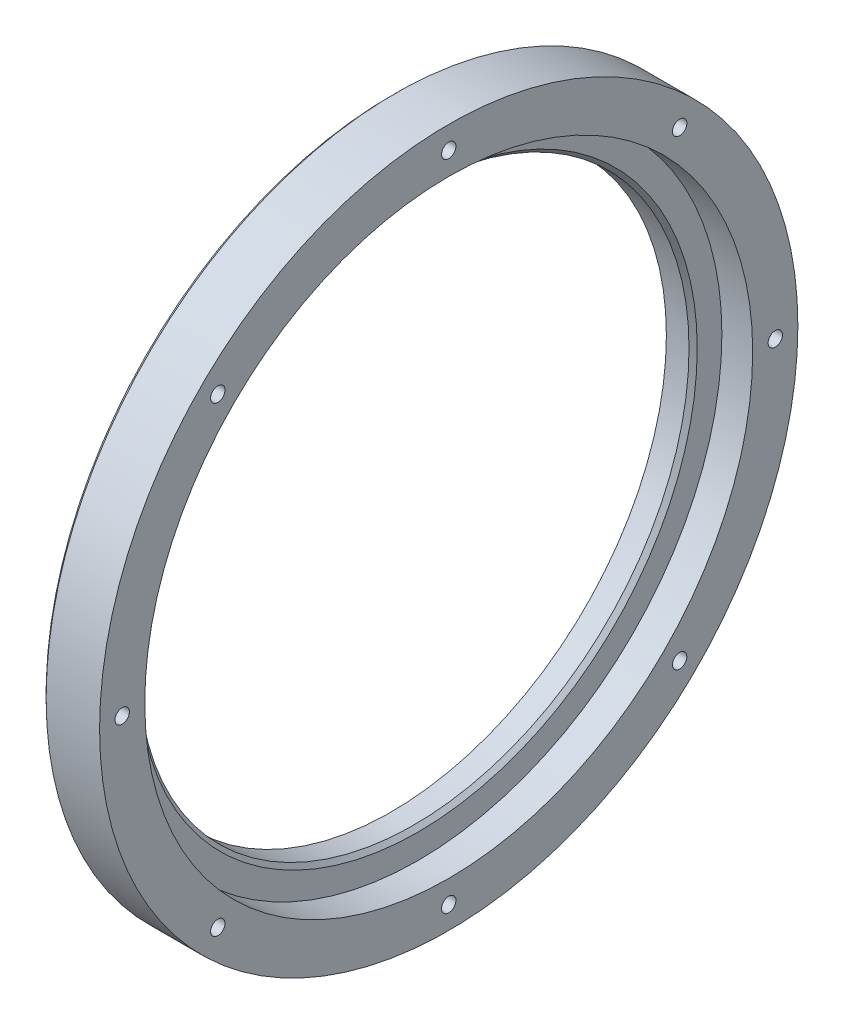
ISO-10303-21;
HEADER;
FILE_DESCRIPTION(('STEP AP214'),'2;1');
FILE_NAME('part.step','',(''),(''),'','','');
FILE_SCHEMA(('AUTOMOTIVE_DESIGN { 1 0 10303 214 1 1 1 1 }'));
ENDSEC;
DATA;
#1=APPLICATION_CONTEXT('core data for automotive mechanical design processes');
#2=APPLICATION_PROTOCOL_DEFINITION('international standard','automotive_design',2000,#1);
#3=PRODUCT_CONTEXT('',#1,'mechanical');
#4=PRODUCT('Part','Part','',(#3));
#5=PRODUCT_RELATED_PRODUCT_CATEGORY('part','',(#4));
#6=PRODUCT_DEFINITION_FORMATION('','',#4);
#7=PRODUCT_DEFINITION_CONTEXT('part definition',#1,'design');
#8=PRODUCT_DEFINITION('design','',#6,#7);
#9=PRODUCT_DEFINITION_SHAPE('','',#8);
#10=(LENGTH_UNIT() NAMED_UNIT(*) SI_UNIT(.MILLI.,.METRE.));
#11=(NAMED_UNIT(*) PLANE_ANGLE_UNIT() SI_UNIT($,.RADIAN.));
#12=(NAMED_UNIT(*) SI_UNIT($,.STERADIAN.) SOLID_ANGLE_UNIT());
#13=UNCERTAINTY_MEASURE_WITH_UNIT(LENGTH_MEASURE(1.E-05),#10,'distance_accuracy_value','');
#14=(GEOMETRIC_REPRESENTATION_CONTEXT(3) GLOBAL_UNCERTAINTY_ASSIGNED_CONTEXT((#13)) GLOBAL_UNIT_ASSIGNED_CONTEXT((#10,
#11,#12)) REPRESENTATION_CONTEXT('',''));
#15=CARTESIAN_POINT('',(0.,0.,0.));
#16=DIRECTION('',(0.,0.,1.));
#17=DIRECTION('',(1.,0.,0.));
#18=AXIS2_PLACEMENT_3D('',#15,#16,#17);
#19=CARTESIAN_POINT('',(-272.858046522507,57.2242590790327,56.2149891043305));
#20=DIRECTION('',(-1.,0.,0.));
#21=DIRECTION('',(0.,0.,1.));
#22=AXIS2_PLACEMENT_3D('',#19,#20,#21);
#23=CYLINDRICAL_SURFACE('',#22,1.75000000000001);
#24=CARTESIAN_POINT('',(-272.858046522507,57.2242590790327,56.2149891043305));
#25=DIRECTION('',(-1.,0.,0.));
#26=DIRECTION('',(0.,0.,1.));
#27=AXIS2_PLACEMENT_3D('',#24,#25,#26);
#28=CIRCLE('',#27,1.75000000000001);
#29=CARTESIAN_POINT('',(-272.858046522507,57.2242590790327,57.9649891043306));
#30=VERTEX_POINT('',#29);
#31=EDGE_CURVE('E89',#30,#30,#28,.T.);
#32=ORIENTED_EDGE('',*,*,#31,.F.);
#33=EDGE_LOOP('',(#32));
#34=FACE_BOUND('',#33,.T.);
#35=CARTESIAN_POINT('',(-282.871214875946,57.2242590790327,56.2149891043305));
#36=DIRECTION('',(-1.,0.,0.));
#37=DIRECTION('',(0.,0.,1.));
#38=AXIS2_PLACEMENT_3D('',#35,#36,#37);
#39=CIRCLE('',#38,1.75000000000001);
#40=CARTESIAN_POINT('',(-282.871214875946,57.2242590790327,57.9649891043306));
#41=VERTEX_POINT('',#40);
#42=EDGE_CURVE('E52',#41,#41,#39,.F.);
#43=ORIENTED_EDGE('',*,*,#42,.F.);
#44=EDGE_LOOP('',(#43));
#45=FACE_BOUND('',#44,.T.);
#46=ADVANCED_FACE('F34',(#34,#45),#23,.F.);
#47=CARTESIAN_POINT('',(-272.858046522507,80.5092699747022,0.));
#48=DIRECTION('',(-1.,0.,0.));
#49=DIRECTION('',(0.,0.,1.));
#50=AXIS2_PLACEMENT_3D('',#47,#48,#49);
#51=CYLINDRICAL_SURFACE('',#50,1.75000000000001);
#52=CARTESIAN_POINT('',(-272.858046522507,80.5092699747022,0.));
#53=DIRECTION('',(-1.,0.,0.));
#54=DIRECTION('',(0.,0.,1.));
#55=AXIS2_PLACEMENT_3D('',#52,#53,#54);
#56=CIRCLE('',#55,1.75000000000001);
#57=CARTESIAN_POINT('',(-272.858046522507,80.5092699747022,1.75000000000001));
#58=VERTEX_POINT('',#57);
#59=EDGE_CURVE('E124',#58,#58,#56,.T.);
#60=ORIENTED_EDGE('',*,*,#59,.F.);
#61=EDGE_LOOP('',(#60));
#62=FACE_BOUND('',#61,.T.);
#63=CARTESIAN_POINT('',(-282.871214875946,80.5092699747022,0.));
#64=DIRECTION('',(-1.,0.,0.));
#65=DIRECTION('',(0.,0.,1.));
#66=AXIS2_PLACEMENT_3D('',#63,#64,#65);
#67=CIRCLE('',#66,1.75000000000001);
#68=CARTESIAN_POINT('',(-282.871214875946,80.5092699747022,1.75000000000001));
#69=VERTEX_POINT('',#68);
#70=EDGE_CURVE('E57',#69,#69,#67,.F.);
#71=ORIENTED_EDGE('',*,*,#70,.F.);
#72=EDGE_LOOP('',(#71));
#73=FACE_BOUND('',#72,.T.);
#74=ADVANCED_FACE('F229',(#62,#73),#51,.F.);
#75=CARTESIAN_POINT('',(-272.858046522507,57.2242590790327,-56.2149891043305));
#76=DIRECTION('',(-1.,0.,0.));
#77=DIRECTION('',(0.,0.,1.));
#78=AXIS2_PLACEMENT_3D('',#75,#76,#77);
#79=CYLINDRICAL_SURFACE('',#78,1.75000000000001);
#80=CARTESIAN_POINT('',(-272.858046522507,57.2242590790327,-56.2149891043305));
#81=DIRECTION('',(-1.,0.,0.));
#82=DIRECTION('',(0.,0.,1.));
#83=AXIS2_PLACEMENT_3D('',#80,#81,#82);
#84=CIRCLE('',#83,1.75000000000001);
#85=CARTESIAN_POINT('',(-272.858046522507,57.2242590790327,-54.4649891043305));
#86=VERTEX_POINT('',#85);
#87=EDGE_CURVE('E121',#86,#86,#84,.T.);
#88=ORIENTED_EDGE('',*,*,#87,.F.);
#89=EDGE_LOOP('',(#88));
#90=FACE_BOUND('',#89,.T.);
#91=CARTESIAN_POINT('',(-282.871214875946,57.2242590790327,-56.2149891043305));
#92=DIRECTION('',(-1.,0.,0.));
#93=DIRECTION('',(0.,0.,1.));
#94=AXIS2_PLACEMENT_3D('',#91,#92,#93);
#95=CIRCLE('',#94,1.75000000000001);
#96=CARTESIAN_POINT('',(-282.871214875946,57.2242590790327,-54.4649891043305));
#97=VERTEX_POINT('',#96);
#98=EDGE_CURVE('E62',#97,#97,#95,.F.);
#99=ORIENTED_EDGE('',*,*,#98,.F.);
#100=EDGE_LOOP('',(#99));
#101=FACE_BOUND('',#100,.T.);
#102=ADVANCED_FACE('F235',(#90,#101),#79,.F.);
#103=CARTESIAN_POINT('',(-272.858046522507,1.00926997470218,-79.5));
#104=DIRECTION('',(-1.,0.,0.));
#105=DIRECTION('',(0.,0.,1.));
#106=AXIS2_PLACEMENT_3D('',#103,#104,#105);
#107=CYLINDRICAL_SURFACE('',#106,1.75);
#108=CARTESIAN_POINT('',(-272.858046522507,1.00926997470218,-79.5));
#109=DIRECTION('',(-1.,0.,0.));
#110=DIRECTION('',(0.,0.,1.));
#111=AXIS2_PLACEMENT_3D('',#108,#109,#110);
#112=CIRCLE('',#111,1.75);
#113=CARTESIAN_POINT('',(-272.858046522507,1.00926997470218,-77.75));
#114=VERTEX_POINT('',#113);
#115=EDGE_CURVE('E118',#114,#114,#112,.T.);
#116=ORIENTED_EDGE('',*,*,#115,.F.);
#117=EDGE_LOOP('',(#116));
#118=FACE_BOUND('',#117,.T.);
#119=CARTESIAN_POINT('',(-282.871214875946,1.00926997470218,-79.5));
#120=DIRECTION('',(-1.,0.,0.));
#121=DIRECTION('',(0.,0.,1.));
#122=AXIS2_PLACEMENT_3D('',#119,#120,#121);
#123=CIRCLE('',#122,1.75);
#124=CARTESIAN_POINT('',(-282.871214875946,1.00926997470218,-77.75));
#125=VERTEX_POINT('',#124);
#126=EDGE_CURVE('E67',#125,#125,#123,.F.);
#127=ORIENTED_EDGE('',*,*,#126,.F.);
#128=EDGE_LOOP('',(#127));
#129=FACE_BOUND('',#128,.T.);
#130=ADVANCED_FACE('F246',(#118,#129),#107,.F.);
#131=CARTESIAN_POINT('',(-272.858046522507,-55.2057191296284,-56.2149891043306));
#132=DIRECTION('',(-1.,0.,0.));
#133=DIRECTION('',(0.,0.,1.));
#134=AXIS2_PLACEMENT_3D('',#131,#132,#133);
#135=CYLINDRICAL_SURFACE('',#134,1.75000000000001);
#136=CARTESIAN_POINT('',(-272.858046522507,-55.2057191296284,-56.2149891043306));
#137=DIRECTION('',(-1.,0.,0.));
#138=DIRECTION('',(0.,0.,1.));
#139=AXIS2_PLACEMENT_3D('',#136,#137,#138);
#140=CIRCLE('',#139,1.75000000000001);
#141=CARTESIAN_POINT('',(-272.858046522507,-55.2057191296284,-54.4649891043305));
#142=VERTEX_POINT('',#141);
#143=EDGE_CURVE('E115',#142,#142,#140,.T.);
#144=ORIENTED_EDGE('',*,*,#143,.F.);
#145=EDGE_LOOP('',(#144));
#146=FACE_BOUND('',#145,.T.);
#147=CARTESIAN_POINT('',(-282.871214875946,-55.2057191296284,-56.2149891043306));
#148=DIRECTION('',(-1.,0.,0.));
#149=DIRECTION('',(0.,0.,1.));
#150=AXIS2_PLACEMENT_3D('',#147,#148,#149);
#151=CIRCLE('',#150,1.75000000000001);
#152=CARTESIAN_POINT('',(-282.871214875946,-55.2057191296284,-54.4649891043305));
#153=VERTEX_POINT('',#152);
#154=EDGE_CURVE('E72',#153,#153,#151,.F.);
#155=ORIENTED_EDGE('',*,*,#154,.F.);
#156=EDGE_LOOP('',(#155));
#157=FACE_BOUND('',#156,.T.);
#158=ADVANCED_FACE('F250',(#146,#157),#135,.F.);
#159=CARTESIAN_POINT('',(-272.858046522507,-78.4907300252979,0.));
#160=DIRECTION('',(-1.,0.,0.));
#161=DIRECTION('',(0.,0.,1.));
#162=AXIS2_PLACEMENT_3D('',#159,#160,#161);
#163=CYLINDRICAL_SURFACE('',#162,1.75000000000001);
#164=CARTESIAN_POINT('',(-272.858046522507,-78.4907300252979,0.));
#165=DIRECTION('',(-1.,0.,0.));
#166=DIRECTION('',(0.,0.,1.));
#167=AXIS2_PLACEMENT_3D('',#164,#165,#166);
#168=CIRCLE('',#167,1.75000000000001);
#169=CARTESIAN_POINT('',(-272.858046522507,-78.4907300252979,1.75));
#170=VERTEX_POINT('',#169);
#171=EDGE_CURVE('E112',#170,#170,#168,.T.);
#172=ORIENTED_EDGE('',*,*,#171,.F.);
#173=EDGE_LOOP('',(#172));
#174=FACE_BOUND('',#173,.T.);
#175=CARTESIAN_POINT('',(-282.871214875946,-78.4907300252979,0.));
#176=DIRECTION('',(-1.,0.,0.));
#177=DIRECTION('',(0.,0.,1.));
#178=AXIS2_PLACEMENT_3D('',#175,#176,#177);
#179=CIRCLE('',#178,1.75000000000001);
#180=CARTESIAN_POINT('',(-282.871214875946,-78.4907300252979,1.75));
#181=VERTEX_POINT('',#180);
#182=EDGE_CURVE('E77',#181,#181,#179,.F.);
#183=ORIENTED_EDGE('',*,*,#182,.F.);
#184=EDGE_LOOP('',(#183));
#185=FACE_BOUND('',#184,.T.);
#186=ADVANCED_FACE('F254',(#174,#185),#163,.F.);
#187=CARTESIAN_POINT('',(-272.858046522507,-55.2057191296284,56.2149891043305));
#188=DIRECTION('',(-1.,0.,0.));
#189=DIRECTION('',(0.,0.,1.));
#190=AXIS2_PLACEMENT_3D('',#187,#188,#189);
#191=CYLINDRICAL_SURFACE('',#190,1.75000000000001);
#192=CARTESIAN_POINT('',(-272.858046522507,-55.2057191296284,56.2149891043305));
#193=DIRECTION('',(-1.,0.,0.));
#194=DIRECTION('',(0.,0.,1.));
#195=AXIS2_PLACEMENT_3D('',#192,#193,#194);
#196=CIRCLE('',#195,1.75000000000001);
#197=CARTESIAN_POINT('',(-272.858046522507,-55.2057191296284,57.9649891043306));
#198=VERTEX_POINT('',#197);
#199=EDGE_CURVE('E109',#198,#198,#196,.T.);
#200=ORIENTED_EDGE('',*,*,#199,.F.);
#201=EDGE_LOOP('',(#200));
#202=FACE_BOUND('',#201,.T.);
#203=CARTESIAN_POINT('',(-282.871214875946,-55.2057191296284,56.2149891043305));
#204=DIRECTION('',(-1.,0.,0.));
#205=DIRECTION('',(0.,0.,1.));
#206=AXIS2_PLACEMENT_3D('',#203,#204,#205);
#207=CIRCLE('',#206,1.75000000000001);
#208=CARTESIAN_POINT('',(-282.871214875946,-55.2057191296284,57.9649891043306));
#209=VERTEX_POINT('',#208);
#210=EDGE_CURVE('E82',#209,#209,#207,.F.);
#211=ORIENTED_EDGE('',*,*,#210,.F.);
#212=EDGE_LOOP('',(#211));
#213=FACE_BOUND('',#212,.T.);
#214=ADVANCED_FACE('F258',(#202,#213),#191,.F.);
#215=CARTESIAN_POINT('',(-272.858046522507,1.00926997470216,79.5));
#216=DIRECTION('',(-1.,0.,0.));
#217=DIRECTION('',(0.,0.,1.));
#218=AXIS2_PLACEMENT_3D('',#215,#216,#217);
#219=CYLINDRICAL_SURFACE('',#218,1.75000000000001);
#220=CARTESIAN_POINT('',(-272.858046522507,1.00926997470216,79.5));
#221=DIRECTION('',(-1.,0.,0.));
#222=DIRECTION('',(0.,0.,1.));
#223=AXIS2_PLACEMENT_3D('',#220,#221,#222);
#224=CIRCLE('',#223,1.75000000000001);
#225=CARTESIAN_POINT('',(-272.858046522507,1.00926997470216,81.25));
#226=VERTEX_POINT('',#225);
#227=EDGE_CURVE('E106',#226,#226,#224,.T.);
#228=ORIENTED_EDGE('',*,*,#227,.F.);
#229=EDGE_LOOP('',(#228));
#230=FACE_BOUND('',#229,.T.);
#231=CARTESIAN_POINT('',(-282.871214875946,1.00926997470216,79.5));
#232=DIRECTION('',(-1.,0.,0.));
#233=DIRECTION('',(0.,0.,1.));
#234=AXIS2_PLACEMENT_3D('',#231,#232,#233);
#235=CIRCLE('',#234,1.75000000000001);
#236=CARTESIAN_POINT('',(-282.871214875946,1.00926997470216,81.25));
#237=VERTEX_POINT('',#236);
#238=EDGE_CURVE('E87',#237,#237,#235,.F.);
#239=ORIENTED_EDGE('',*,*,#238,.F.);
#240=EDGE_LOOP('',(#239));
#241=FACE_BOUND('',#240,.T.);
#242=ADVANCED_FACE('F212',(#230,#241),#219,.F.);
#243=CARTESIAN_POINT('',(-272.858046522507,75.0092699747022,0.));
#244=DIRECTION('',(1.,0.,0.));
#245=DIRECTION('',(0.,0.,-1.));
#246=AXIS2_PLACEMENT_3D('',#243,#244,#245);
#247=PLANE('',#246);
#248=ORIENTED_EDGE('',*,*,#31,.T.);
#249=EDGE_LOOP('',(#248));
#250=FACE_BOUND('',#249,.T.);
#251=ORIENTED_EDGE('',*,*,#59,.T.);
#252=EDGE_LOOP('',(#251));
#253=FACE_BOUND('',#252,.T.);
#254=ORIENTED_EDGE('',*,*,#87,.T.);
#255=EDGE_LOOP('',(#254));
#256=FACE_BOUND('',#255,.T.);
#257=ORIENTED_EDGE('',*,*,#115,.T.);
#258=EDGE_LOOP('',(#257));
#259=FACE_BOUND('',#258,.T.);
#260=ORIENTED_EDGE('',*,*,#143,.T.);
#261=EDGE_LOOP('',(#260));
#262=FACE_BOUND('',#261,.T.);
#263=ORIENTED_EDGE('',*,*,#171,.T.);
#264=EDGE_LOOP('',(#263));
#265=FACE_BOUND('',#264,.T.);
#266=ORIENTED_EDGE('',*,*,#199,.T.);
#267=EDGE_LOOP('',(#266));
#268=FACE_BOUND('',#267,.T.);
#269=ORIENTED_EDGE('',*,*,#227,.T.);
#270=EDGE_LOOP('',(#269));
#271=FACE_BOUND('',#270,.T.);
#272=CARTESIAN_POINT('',(-272.858046522507,1.00926997470217,0.));
#273=DIRECTION('',(1.,0.,0.));
#274=DIRECTION('',(0.,0.,-1.));
#275=AXIS2_PLACEMENT_3D('',#272,#273,#274);
#276=CIRCLE('',#275,85.);
#277=CARTESIAN_POINT('',(-272.858046522507,1.00926997470217,-85.));
#278=VERTEX_POINT('',#277);
#279=EDGE_CURVE('E103',#278,#278,#276,.T.);
#280=ORIENTED_EDGE('',*,*,#279,.T.);
#281=EDGE_LOOP('',(#280));
#282=FACE_BOUND('',#281,.T.);
#283=CARTESIAN_POINT('',(-272.858046522507,1.00926997470217,0.));
#284=DIRECTION('',(1.,0.,0.));
#285=DIRECTION('',(0.,0.,-1.));
#286=AXIS2_PLACEMENT_3D('',#283,#284,#285);
#287=CIRCLE('',#286,74.);
#288=CARTESIAN_POINT('',(-272.858046522507,1.00926997470217,-74.));
#289=VERTEX_POINT('',#288);
#290=EDGE_CURVE('E45',#289,#289,#287,.T.);
#291=ORIENTED_EDGE('',*,*,#290,.F.);
#292=EDGE_LOOP('',(#291));
#293=FACE_BOUND('',#292,.T.);
#294=ADVANCED_FACE('F208',(#250,#253,#256,#259,#262,#265,#268,#271,#282,#293),#247,.T.);
#295=CARTESIAN_POINT('',(-268.908046522507,1.00926997470217,0.));
#296=DIRECTION('',(1.,0.,0.));
#297=DIRECTION('',(0.,0.,-1.));
#298=AXIS2_PLACEMENT_3D('',#295,#296,#297);
#299=CYLINDRICAL_SURFACE('',#298,74.);
#300=ORIENTED_EDGE('',*,*,#290,.T.);
#301=EDGE_LOOP('',(#300));
#302=FACE_BOUND('',#301,.T.);
#303=CARTESIAN_POINT('',(-280.358046522507,1.00926997470217,0.));
#304=DIRECTION('',(1.,0.,0.));
#305=DIRECTION('',(0.,0.,-1.));
#306=AXIS2_PLACEMENT_3D('',#303,#304,#305);
#307=CIRCLE('',#306,74.);
#308=CARTESIAN_POINT('',(-280.358046522507,1.00926997470217,-74.));
#309=VERTEX_POINT('',#308);
#310=EDGE_CURVE('E49',#309,#309,#307,.T.);
#311=ORIENTED_EDGE('',*,*,#310,.F.);
#312=EDGE_LOOP('',(#311));
#313=FACE_BOUND('',#312,.T.);
#314=ADVANCED_FACE('F211',(#302,#313),#299,.F.);
#315=CARTESIAN_POINT('',(-280.358046522507,75.0092699747022,0.));
#316=DIRECTION('',(1.,0.,0.));
#317=DIRECTION('',(0.,0.,-1.));
#318=AXIS2_PLACEMENT_3D('',#315,#316,#317);
#319=PLANE('',#318);
#320=CARTESIAN_POINT('',(-280.358046522507,1.00926997470217,0.));
#321=DIRECTION('',(1.,0.,0.));
#322=DIRECTION('',(0.,0.,-1.));
#323=AXIS2_PLACEMENT_3D('',#320,#321,#322);
#324=CIRCLE('',#323,68.);
#325=CARTESIAN_POINT('',(-280.358046522507,1.00926997470217,-68.));
#326=VERTEX_POINT('',#325);
#327=EDGE_CURVE('E10',#326,#326,#324,.F.);
#328=ORIENTED_EDGE('',*,*,#327,.T.);
#329=EDGE_LOOP('',(#328));
#330=FACE_BOUND('',#329,.T.);
#331=ORIENTED_EDGE('',*,*,#310,.T.);
#332=EDGE_LOOP('',(#331));
#333=FACE_BOUND('',#332,.T.);
#334=ADVANCED_FACE('F218',(#330,#333),#319,.T.);
#335=CARTESIAN_POINT('',(-268.908046522507,1.00926997470217,0.));
#336=DIRECTION('',(1.,0.,0.));
#337=DIRECTION('',(0.,0.,-1.));
#338=AXIS2_PLACEMENT_3D('',#335,#336,#337);
#339=CYLINDRICAL_SURFACE('',#338,67.);
#340=CARTESIAN_POINT('',(-281.358046522507,1.00926997470217,0.));
#341=DIRECTION('',(1.,0.,0.));
#342=DIRECTION('',(0.,0.,-1.));
#343=AXIS2_PLACEMENT_3D('',#340,#341,#342);
#344=CIRCLE('',#343,67.);
#345=CARTESIAN_POINT('',(-281.358046522507,1.00926997470217,-67.));
#346=VERTEX_POINT('',#345);
#347=EDGE_CURVE('E41',#346,#346,#344,.T.);
#348=ORIENTED_EDGE('',*,*,#347,.T.);
#349=EDGE_LOOP('',(#348));
#350=FACE_BOUND('',#349,.T.);
#351=CARTESIAN_POINT('',(-286.871214875946,1.00926997470217,0.));
#352=DIRECTION('',(1.,0.,0.));
#353=DIRECTION('',(0.,0.,-1.));
#354=AXIS2_PLACEMENT_3D('',#351,#352,#353);
#355=CIRCLE('',#354,67.);
#356=CARTESIAN_POINT('',(-286.871214875946,1.00926997470217,-67.));
#357=VERTEX_POINT('',#356);
#358=EDGE_CURVE('E94',#357,#357,#355,.T.);
#359=ORIENTED_EDGE('',*,*,#358,.F.);
#360=EDGE_LOOP('',(#359));
#361=FACE_BOUND('',#360,.T.);
#362=ADVANCED_FACE('F176',(#350,#361),#339,.F.);
#363=CARTESIAN_POINT('',(-286.871214875946,68.0092699747022,0.));
#364=DIRECTION('',(-1.,0.,0.));
#365=DIRECTION('',(0.,0.,1.));
#366=AXIS2_PLACEMENT_3D('',#363,#364,#365);
#367=PLANE('',#366);
#368=CARTESIAN_POINT('',(-286.871214875946,57.2242590790327,56.2149891043305));
#369=DIRECTION('',(-1.,0.,0.));
#370=DIRECTION('',(0.,0.,1.));
#371=AXIS2_PLACEMENT_3D('',#368,#369,#370);
#372=CIRCLE('',#371,3.00000000000002);
#373=CARTESIAN_POINT('',(-286.871214875946,57.2242590790327,59.2149891043306));
#374=VERTEX_POINT('',#373);
#375=EDGE_CURVE('E157',#374,#374,#372,.T.);
#376=ORIENTED_EDGE('',*,*,#375,.F.);
#377=EDGE_LOOP('',(#376));
#378=FACE_BOUND('',#377,.T.);
#379=CARTESIAN_POINT('',(-286.871214875946,80.5092699747022,0.));
#380=DIRECTION('',(-1.,0.,0.));
#381=DIRECTION('',(0.,0.,1.));
#382=AXIS2_PLACEMENT_3D('',#379,#380,#381);
#383=CIRCLE('',#382,3.00000000000001);
#384=CARTESIAN_POINT('',(-286.871214875946,80.5092699747022,3.00000000000001));
#385=VERTEX_POINT('',#384);
#386=EDGE_CURVE('E55',#385,#385,#383,.T.);
#387=ORIENTED_EDGE('',*,*,#386,.F.);
#388=EDGE_LOOP('',(#387));
#389=FACE_BOUND('',#388,.T.);
#390=CARTESIAN_POINT('',(-286.871214875946,57.2242590790327,-56.2149891043305));
#391=DIRECTION('',(-1.,0.,0.));
#392=DIRECTION('',(0.,0.,1.));
#393=AXIS2_PLACEMENT_3D('',#390,#391,#392);
#394=CIRCLE('',#393,3.00000000000001);
#395=CARTESIAN_POINT('',(-286.871214875946,57.2242590790327,-53.2149891043305));
#396=VERTEX_POINT('',#395);
#397=EDGE_CURVE('E60',#396,#396,#394,.T.);
#398=ORIENTED_EDGE('',*,*,#397,.F.);
#399=EDGE_LOOP('',(#398));
#400=FACE_BOUND('',#399,.T.);
#401=CARTESIAN_POINT('',(-286.871214875946,1.00926997470217,-79.5));
#402=DIRECTION('',(-1.,0.,0.));
#403=DIRECTION('',(0.,0.,1.));
#404=AXIS2_PLACEMENT_3D('',#401,#402,#403);
#405=CIRCLE('',#404,3.00000000000002);
#406=CARTESIAN_POINT('',(-286.871214875946,1.00926997470217,-76.5));
#407=VERTEX_POINT('',#406);
#408=EDGE_CURVE('E65',#407,#407,#405,.T.);
#409=ORIENTED_EDGE('',*,*,#408,.F.);
#410=EDGE_LOOP('',(#409));
#411=FACE_BOUND('',#410,.T.);
#412=CARTESIAN_POINT('',(-286.871214875946,-55.2057191296284,-56.2149891043306));
#413=DIRECTION('',(-1.,0.,0.));
#414=DIRECTION('',(0.,0.,1.));
#415=AXIS2_PLACEMENT_3D('',#412,#413,#414);
#416=CIRCLE('',#415,3.00000000000001);
#417=CARTESIAN_POINT('',(-286.871214875946,-55.2057191296284,-53.2149891043305));
#418=VERTEX_POINT('',#417);
#419=EDGE_CURVE('E70',#418,#418,#416,.T.);
#420=ORIENTED_EDGE('',*,*,#419,.F.);
#421=EDGE_LOOP('',(#420));
#422=FACE_BOUND('',#421,.T.);
#423=CARTESIAN_POINT('',(-286.871214875946,-78.4907300252979,0.));
#424=DIRECTION('',(-1.,0.,0.));
#425=DIRECTION('',(0.,0.,1.));
#426=AXIS2_PLACEMENT_3D('',#423,#424,#425);
#427=CIRCLE('',#426,3.00000000000002);
#428=CARTESIAN_POINT('',(-286.871214875946,-78.4907300252979,3.00000000000001));
#429=VERTEX_POINT('',#428);
#430=EDGE_CURVE('E75',#429,#429,#427,.T.);
#431=ORIENTED_EDGE('',*,*,#430,.F.);
#432=EDGE_LOOP('',(#431));
#433=FACE_BOUND('',#432,.T.);
#434=CARTESIAN_POINT('',(-286.871214875946,-55.2057191296284,56.2149891043305));
#435=DIRECTION('',(-1.,0.,0.));
#436=DIRECTION('',(0.,0.,1.));
#437=AXIS2_PLACEMENT_3D('',#434,#435,#436);
#438=CIRCLE('',#437,3.00000000000002);
#439=CARTESIAN_POINT('',(-286.871214875946,-55.2057191296284,59.2149891043306));
#440=VERTEX_POINT('',#439);
#441=EDGE_CURVE('E80',#440,#440,#438,.T.);
#442=ORIENTED_EDGE('',*,*,#441,.F.);
#443=EDGE_LOOP('',(#442));
#444=FACE_BOUND('',#443,.T.);
#445=CARTESIAN_POINT('',(-286.871214875946,1.00926997470216,79.5));
#446=DIRECTION('',(-1.,0.,0.));
#447=DIRECTION('',(0.,0.,1.));
#448=AXIS2_PLACEMENT_3D('',#445,#446,#447);
#449=CIRCLE('',#448,3.00000000000002);
#450=CARTESIAN_POINT('',(-286.871214875946,1.00926997470216,82.5));
#451=VERTEX_POINT('',#450);
#452=EDGE_CURVE('E85',#451,#451,#449,.T.);
#453=ORIENTED_EDGE('',*,*,#452,.F.);
#454=EDGE_LOOP('',(#453));
#455=FACE_BOUND('',#454,.T.);
#456=ORIENTED_EDGE('',*,*,#358,.T.);
#457=EDGE_LOOP('',(#456));
#458=FACE_BOUND('',#457,.T.);
#459=CARTESIAN_POINT('',(-286.871214875946,1.00926997470217,0.));
#460=DIRECTION('',(1.,0.,0.));
#461=DIRECTION('',(0.,0.,-1.));
#462=AXIS2_PLACEMENT_3D('',#459,#460,#461);
#463=CIRCLE('',#462,84.);
#464=CARTESIAN_POINT('',(-286.871214875946,1.00926997470217,-84.));
#465=VERTEX_POINT('',#464);
#466=EDGE_CURVE('E97',#465,#465,#463,.T.);
#467=ORIENTED_EDGE('',*,*,#466,.F.);
#468=EDGE_LOOP('',(#467));
#469=FACE_BOUND('',#468,.T.);
#470=ADVANCED_FACE('F172',(#378,#389,#400,#411,#422,#433,#444,#455,#458,#469),#367,.T.);
#471=CARTESIAN_POINT('',(-285.871214875946,1.00926997470217,0.));
#472=DIRECTION('',(1.,0.,0.));
#473=DIRECTION('',(0.,0.,-1.));
#474=AXIS2_PLACEMENT_3D('',#471,#472,#473);
#475=CONICAL_SURFACE('',#474,85.,0.785398163397448);
#476=ORIENTED_EDGE('',*,*,#466,.T.);
#477=EDGE_LOOP('',(#476));
#478=FACE_BOUND('',#477,.T.);
#479=CARTESIAN_POINT('',(-285.871214875946,1.00926997470217,0.));
#480=DIRECTION('',(1.,0.,0.));
#481=DIRECTION('',(0.,0.,-1.));
#482=AXIS2_PLACEMENT_3D('',#479,#480,#481);
#483=CIRCLE('',#482,85.);
#484=CARTESIAN_POINT('',(-285.871214875946,1.00926997470217,-85.));
#485=VERTEX_POINT('',#484);
#486=EDGE_CURVE('E100',#485,#485,#483,.T.);
#487=ORIENTED_EDGE('',*,*,#486,.F.);
#488=EDGE_LOOP('',(#487));
#489=FACE_BOUND('',#488,.T.);
#490=ADVANCED_FACE('F175',(#478,#489),#475,.T.);
#491=CARTESIAN_POINT('',(-268.908046522507,1.00926997470217,0.));
#492=DIRECTION('',(1.,0.,0.));
#493=DIRECTION('',(0.,0.,-1.));
#494=AXIS2_PLACEMENT_3D('',#491,#492,#493);
#495=CYLINDRICAL_SURFACE('',#494,85.);
#496=ORIENTED_EDGE('',*,*,#486,.T.);
#497=EDGE_LOOP('',(#496));
#498=FACE_BOUND('',#497,.T.);
#499=ORIENTED_EDGE('',*,*,#279,.F.);
#500=EDGE_LOOP('',(#499));
#501=FACE_BOUND('',#500,.T.);
#502=ADVANCED_FACE('F198',(#498,#501),#495,.T.);
#503=CARTESIAN_POINT('',(-282.871214875946,1.00926997470216,79.5));
#504=DIRECTION('',(-1.,0.,0.));
#505=DIRECTION('',(0.,0.,1.));
#506=AXIS2_PLACEMENT_3D('',#503,#504,#505);
#507=PLANE('',#506);
#508=CARTESIAN_POINT('',(-282.871214875946,1.00926997470216,79.5));
#509=DIRECTION('',(-1.,0.,0.));
#510=DIRECTION('',(0.,0.,1.));
#511=AXIS2_PLACEMENT_3D('',#508,#509,#510);
#512=CIRCLE('',#511,3.00000000000002);
#513=CARTESIAN_POINT('',(-282.871214875946,1.00926997470216,82.5));
#514=VERTEX_POINT('',#513);
#515=EDGE_CURVE('E90',#514,#514,#512,.T.);
#516=ORIENTED_EDGE('',*,*,#515,.T.);
#517=EDGE_LOOP('',(#516));
#518=FACE_BOUND('',#517,.T.);
#519=ORIENTED_EDGE('',*,*,#238,.T.);
#520=EDGE_LOOP('',(#519));
#521=FACE_BOUND('',#520,.T.);
#522=ADVANCED_FACE('F204',(#518,#521),#507,.T.);
#523=CARTESIAN_POINT('',(-282.871214875946,1.00926997470216,79.5));
#524=DIRECTION('',(-1.,0.,0.));
#525=DIRECTION('',(0.,0.,1.));
#526=AXIS2_PLACEMENT_3D('',#523,#524,#525);
#527=CYLINDRICAL_SURFACE('',#526,3.00000000000002);
#528=ORIENTED_EDGE('',*,*,#515,.F.);
#529=EDGE_LOOP('',(#528));
#530=FACE_BOUND('',#529,.T.);
#531=ORIENTED_EDGE('',*,*,#452,.T.);
#532=EDGE_LOOP('',(#531));
#533=FACE_BOUND('',#532,.T.);
#534=ADVANCED_FACE('F241',(#530,#533),#527,.F.);
#535=CARTESIAN_POINT('',(-282.871214875946,-55.2057191296284,56.2149891043305));
#536=DIRECTION('',(-1.,0.,0.));
#537=DIRECTION('',(0.,0.,1.));
#538=AXIS2_PLACEMENT_3D('',#535,#536,#537);
#539=PLANE('',#538);
#540=CARTESIAN_POINT('',(-282.871214875946,-55.2057191296284,56.2149891043305));
#541=DIRECTION('',(-1.,0.,0.));
#542=DIRECTION('',(0.,0.,1.));
#543=AXIS2_PLACEMENT_3D('',#540,#541,#542);
#544=CIRCLE('',#543,3.00000000000002);
#545=CARTESIAN_POINT('',(-282.871214875946,-55.2057191296284,59.2149891043306));
#546=VERTEX_POINT('',#545);
#547=EDGE_CURVE('E86',#546,#546,#544,.T.);
#548=ORIENTED_EDGE('',*,*,#547,.T.);
#549=EDGE_LOOP('',(#548));
#550=FACE_BOUND('',#549,.T.);
#551=ORIENTED_EDGE('',*,*,#210,.T.);
#552=EDGE_LOOP('',(#551));
#553=FACE_BOUND('',#552,.T.);
#554=ADVANCED_FACE('F276',(#550,#553),#539,.T.);
#555=CARTESIAN_POINT('',(-282.871214875946,-55.2057191296284,56.2149891043305));
#556=DIRECTION('',(-1.,0.,0.));
#557=DIRECTION('',(0.,0.,1.));
#558=AXIS2_PLACEMENT_3D('',#555,#556,#557);
#559=CYLINDRICAL_SURFACE('',#558,3.00000000000002);
#560=ORIENTED_EDGE('',*,*,#547,.F.);
#561=EDGE_LOOP('',(#560));
#562=FACE_BOUND('',#561,.T.);
#563=ORIENTED_EDGE('',*,*,#441,.T.);
#564=EDGE_LOOP('',(#563));
#565=FACE_BOUND('',#564,.T.);
#566=ADVANCED_FACE('F279',(#562,#565),#559,.F.);
#567=CARTESIAN_POINT('',(-282.871214875946,-78.4907300252979,0.));
#568=DIRECTION('',(-1.,0.,0.));
#569=DIRECTION('',(0.,0.,1.));
#570=AXIS2_PLACEMENT_3D('',#567,#568,#569);
#571=PLANE('',#570);
#572=CARTESIAN_POINT('',(-282.871214875946,-78.4907300252979,0.));
#573=DIRECTION('',(-1.,0.,0.));
#574=DIRECTION('',(0.,0.,1.));
#575=AXIS2_PLACEMENT_3D('',#572,#573,#574);
#576=CIRCLE('',#575,3.00000000000002);
#577=CARTESIAN_POINT('',(-282.871214875946,-78.4907300252979,3.00000000000001));
#578=VERTEX_POINT('',#577);
#579=EDGE_CURVE('E81',#578,#578,#576,.T.);
#580=ORIENTED_EDGE('',*,*,#579,.T.);
#581=EDGE_LOOP('',(#580));
#582=FACE_BOUND('',#581,.T.);
#583=ORIENTED_EDGE('',*,*,#182,.T.);
#584=EDGE_LOOP('',(#583));
#585=FACE_BOUND('',#584,.T.);
#586=ADVANCED_FACE('F282',(#582,#585),#571,.T.);
#587=CARTESIAN_POINT('',(-282.871214875946,-78.4907300252979,0.));
#588=DIRECTION('',(-1.,0.,0.));
#589=DIRECTION('',(0.,0.,1.));
#590=AXIS2_PLACEMENT_3D('',#587,#588,#589);
#591=CYLINDRICAL_SURFACE('',#590,3.00000000000002);
#592=ORIENTED_EDGE('',*,*,#579,.F.);
#593=EDGE_LOOP('',(#592));
#594=FACE_BOUND('',#593,.T.);
#595=ORIENTED_EDGE('',*,*,#430,.T.);
#596=EDGE_LOOP('',(#595));
#597=FACE_BOUND('',#596,.T.);
#598=ADVANCED_FACE('F287',(#594,#597),#591,.F.);
#599=CARTESIAN_POINT('',(-282.871214875946,-55.2057191296284,-56.2149891043306));
#600=DIRECTION('',(-1.,0.,0.));
#601=DIRECTION('',(0.,0.,1.));
#602=AXIS2_PLACEMENT_3D('',#599,#600,#601);
#603=PLANE('',#602);
#604=CARTESIAN_POINT('',(-282.871214875946,-55.2057191296284,-56.2149891043306));
#605=DIRECTION('',(-1.,0.,0.));
#606=DIRECTION('',(0.,0.,1.));
#607=AXIS2_PLACEMENT_3D('',#604,#605,#606);
#608=CIRCLE('',#607,3.00000000000001);
#609=CARTESIAN_POINT('',(-282.871214875946,-55.2057191296284,-53.2149891043305));
#610=VERTEX_POINT('',#609);
#611=EDGE_CURVE('E76',#610,#610,#608,.T.);
#612=ORIENTED_EDGE('',*,*,#611,.T.);
#613=EDGE_LOOP('',(#612));
#614=FACE_BOUND('',#613,.T.);
#615=ORIENTED_EDGE('',*,*,#154,.T.);
#616=EDGE_LOOP('',(#615));
#617=FACE_BOUND('',#616,.T.);
#618=ADVANCED_FACE('F290',(#614,#617),#603,.T.);
#619=CARTESIAN_POINT('',(-282.871214875946,-55.2057191296284,-56.2149891043306));
#620=DIRECTION('',(-1.,0.,0.));
#621=DIRECTION('',(0.,0.,1.));
#622=AXIS2_PLACEMENT_3D('',#619,#620,#621);
#623=CYLINDRICAL_SURFACE('',#622,3.00000000000001);
#624=ORIENTED_EDGE('',*,*,#611,.F.);
#625=EDGE_LOOP('',(#624));
#626=FACE_BOUND('',#625,.T.);
#627=ORIENTED_EDGE('',*,*,#419,.T.);
#628=EDGE_LOOP('',(#627));
#629=FACE_BOUND('',#628,.T.);
#630=ADVANCED_FACE('F295',(#626,#629),#623,.F.);
#631=CARTESIAN_POINT('',(-282.871214875946,1.00926997470217,-79.5));
#632=DIRECTION('',(-1.,0.,0.));
#633=DIRECTION('',(0.,0.,1.));
#634=AXIS2_PLACEMENT_3D('',#631,#632,#633);
#635=PLANE('',#634);
#636=CARTESIAN_POINT('',(-282.871214875946,1.00926997470217,-79.5));
#637=DIRECTION('',(-1.,0.,0.));
#638=DIRECTION('',(0.,0.,1.));
#639=AXIS2_PLACEMENT_3D('',#636,#637,#638);
#640=CIRCLE('',#639,3.00000000000002);
#641=CARTESIAN_POINT('',(-282.871214875946,1.00926997470217,-76.5));
#642=VERTEX_POINT('',#641);
#643=EDGE_CURVE('E71',#642,#642,#640,.T.);
#644=ORIENTED_EDGE('',*,*,#643,.T.);
#645=EDGE_LOOP('',(#644));
#646=FACE_BOUND('',#645,.T.);
#647=ORIENTED_EDGE('',*,*,#126,.T.);
#648=EDGE_LOOP('',(#647));
#649=FACE_BOUND('',#648,.T.);
#650=ADVANCED_FACE('F298',(#646,#649),#635,.T.);
#651=CARTESIAN_POINT('',(-282.871214875946,1.00926997470217,-79.5));
#652=DIRECTION('',(-1.,0.,0.));
#653=DIRECTION('',(0.,0.,1.));
#654=AXIS2_PLACEMENT_3D('',#651,#652,#653);
#655=CYLINDRICAL_SURFACE('',#654,3.00000000000002);
#656=ORIENTED_EDGE('',*,*,#643,.F.);
#657=EDGE_LOOP('',(#656));
#658=FACE_BOUND('',#657,.T.);
#659=ORIENTED_EDGE('',*,*,#408,.T.);
#660=EDGE_LOOP('',(#659));
#661=FACE_BOUND('',#660,.T.);
#662=ADVANCED_FACE('F303',(#658,#661),#655,.F.);
#663=CARTESIAN_POINT('',(-282.871214875946,57.2242590790327,-56.2149891043305));
#664=DIRECTION('',(-1.,0.,0.));
#665=DIRECTION('',(0.,0.,1.));
#666=AXIS2_PLACEMENT_3D('',#663,#664,#665);
#667=PLANE('',#666);
#668=CARTESIAN_POINT('',(-282.871214875946,57.2242590790327,-56.2149891043305));
#669=DIRECTION('',(-1.,0.,0.));
#670=DIRECTION('',(0.,0.,1.));
#671=AXIS2_PLACEMENT_3D('',#668,#669,#670);
#672=CIRCLE('',#671,3.00000000000001);
#673=CARTESIAN_POINT('',(-282.871214875946,57.2242590790327,-53.2149891043305));
#674=VERTEX_POINT('',#673);
#675=EDGE_CURVE('E66',#674,#674,#672,.T.);
#676=ORIENTED_EDGE('',*,*,#675,.T.);
#677=EDGE_LOOP('',(#676));
#678=FACE_BOUND('',#677,.T.);
#679=ORIENTED_EDGE('',*,*,#98,.T.);
#680=EDGE_LOOP('',(#679));
#681=FACE_BOUND('',#680,.T.);
#682=ADVANCED_FACE('F306',(#678,#681),#667,.T.);
#683=CARTESIAN_POINT('',(-282.871214875946,57.2242590790327,-56.2149891043305));
#684=DIRECTION('',(-1.,0.,0.));
#685=DIRECTION('',(0.,0.,1.));
#686=AXIS2_PLACEMENT_3D('',#683,#684,#685);
#687=CYLINDRICAL_SURFACE('',#686,3.00000000000001);
#688=ORIENTED_EDGE('',*,*,#675,.F.);
#689=EDGE_LOOP('',(#688));
#690=FACE_BOUND('',#689,.T.);
#691=ORIENTED_EDGE('',*,*,#397,.T.);
#692=EDGE_LOOP('',(#691));
#693=FACE_BOUND('',#692,.T.);
#694=ADVANCED_FACE('F311',(#690,#693),#687,.F.);
#695=CARTESIAN_POINT('',(-282.871214875946,80.5092699747022,0.));
#696=DIRECTION('',(-1.,0.,0.));
#697=DIRECTION('',(0.,0.,1.));
#698=AXIS2_PLACEMENT_3D('',#695,#696,#697);
#699=PLANE('',#698);
#700=CARTESIAN_POINT('',(-282.871214875946,80.5092699747022,0.));
#701=DIRECTION('',(-1.,0.,0.));
#702=DIRECTION('',(0.,0.,1.));
#703=AXIS2_PLACEMENT_3D('',#700,#701,#702);
#704=CIRCLE('',#703,3.00000000000001);
#705=CARTESIAN_POINT('',(-282.871214875946,80.5092699747022,3.00000000000001));
#706=VERTEX_POINT('',#705);
#707=EDGE_CURVE('E61',#706,#706,#704,.T.);
#708=ORIENTED_EDGE('',*,*,#707,.T.);
#709=EDGE_LOOP('',(#708));
#710=FACE_BOUND('',#709,.T.);
#711=ORIENTED_EDGE('',*,*,#70,.T.);
#712=EDGE_LOOP('',(#711));
#713=FACE_BOUND('',#712,.T.);
#714=ADVANCED_FACE('F314',(#710,#713),#699,.T.);
#715=CARTESIAN_POINT('',(-282.871214875946,80.5092699747022,0.));
#716=DIRECTION('',(-1.,0.,0.));
#717=DIRECTION('',(0.,0.,1.));
#718=AXIS2_PLACEMENT_3D('',#715,#716,#717);
#719=CYLINDRICAL_SURFACE('',#718,3.00000000000001);
#720=ORIENTED_EDGE('',*,*,#707,.F.);
#721=EDGE_LOOP('',(#720));
#722=FACE_BOUND('',#721,.T.);
#723=ORIENTED_EDGE('',*,*,#386,.T.);
#724=EDGE_LOOP('',(#723));
#725=FACE_BOUND('',#724,.T.);
#726=ADVANCED_FACE('F319',(#722,#725),#719,.F.);
#727=CARTESIAN_POINT('',(-282.871214875946,57.2242590790327,56.2149891043305));
#728=DIRECTION('',(-1.,0.,0.));
#729=DIRECTION('',(0.,0.,1.));
#730=AXIS2_PLACEMENT_3D('',#727,#728,#729);
#731=PLANE('',#730);
#732=CARTESIAN_POINT('',(-282.871214875946,57.2242590790327,56.2149891043305));
#733=DIRECTION('',(-1.,0.,0.));
#734=DIRECTION('',(0.,0.,1.));
#735=AXIS2_PLACEMENT_3D('',#732,#733,#734);
#736=CIRCLE('',#735,3.00000000000002);
#737=CARTESIAN_POINT('',(-282.871214875946,57.2242590790327,59.2149891043306));
#738=VERTEX_POINT('',#737);
#739=EDGE_CURVE('E56',#738,#738,#736,.T.);
#740=ORIENTED_EDGE('',*,*,#739,.T.);
#741=EDGE_LOOP('',(#740));
#742=FACE_BOUND('',#741,.T.);
#743=ORIENTED_EDGE('',*,*,#42,.T.);
#744=EDGE_LOOP('',(#743));
#745=FACE_BOUND('',#744,.T.);
#746=ADVANCED_FACE('F163',(#742,#745),#731,.T.);
#747=CARTESIAN_POINT('',(-282.871214875946,57.2242590790327,56.2149891043305));
#748=DIRECTION('',(-1.,0.,0.));
#749=DIRECTION('',(0.,0.,1.));
#750=AXIS2_PLACEMENT_3D('',#747,#748,#749);
#751=CYLINDRICAL_SURFACE('',#750,3.00000000000002);
#752=ORIENTED_EDGE('',*,*,#739,.F.);
#753=EDGE_LOOP('',(#752));
#754=FACE_BOUND('',#753,.T.);
#755=ORIENTED_EDGE('',*,*,#375,.T.);
#756=EDGE_LOOP('',(#755));
#757=FACE_BOUND('',#756,.T.);
#758=ADVANCED_FACE('F166',(#754,#757),#751,.F.);
#759=CARTESIAN_POINT('',(-281.358046522507,1.00926997470217,0.));
#760=DIRECTION('',(1.,0.,0.));
#761=DIRECTION('',(0.,0.,-1.));
#762=AXIS2_PLACEMENT_3D('',#759,#760,#761);
#763=CONICAL_SURFACE('',#762,67.,0.785398163397455);
#764=ORIENTED_EDGE('',*,*,#327,.F.);
#765=EDGE_LOOP('',(#764));
#766=FACE_BOUND('',#765,.T.);
#767=ORIENTED_EDGE('',*,*,#347,.F.);
#768=EDGE_LOOP('',(#767));
#769=FACE_BOUND('',#768,.T.);
#770=ADVANCED_FACE('F36',(#766,#769),#763,.F.);
#771=CLOSED_SHELL('',(#46,#74,#102,#130,#158,#186,#214,#242,#294,#314,#334,#362,#470,#490,#502,
#522,#534,#554,#566,#586,#598,#618,#630,#650,#662,#682,#694,#714,#726,#746,#758,#770));
#772=MANIFOLD_SOLID_BREP('B2',#771);
#773=ADVANCED_BREP_SHAPE_REPRESENTATION('',(#18,#772),#14);
#774=SHAPE_DEFINITION_REPRESENTATION(#9,#773);
ENDSEC;
END-ISO-10303-21;
